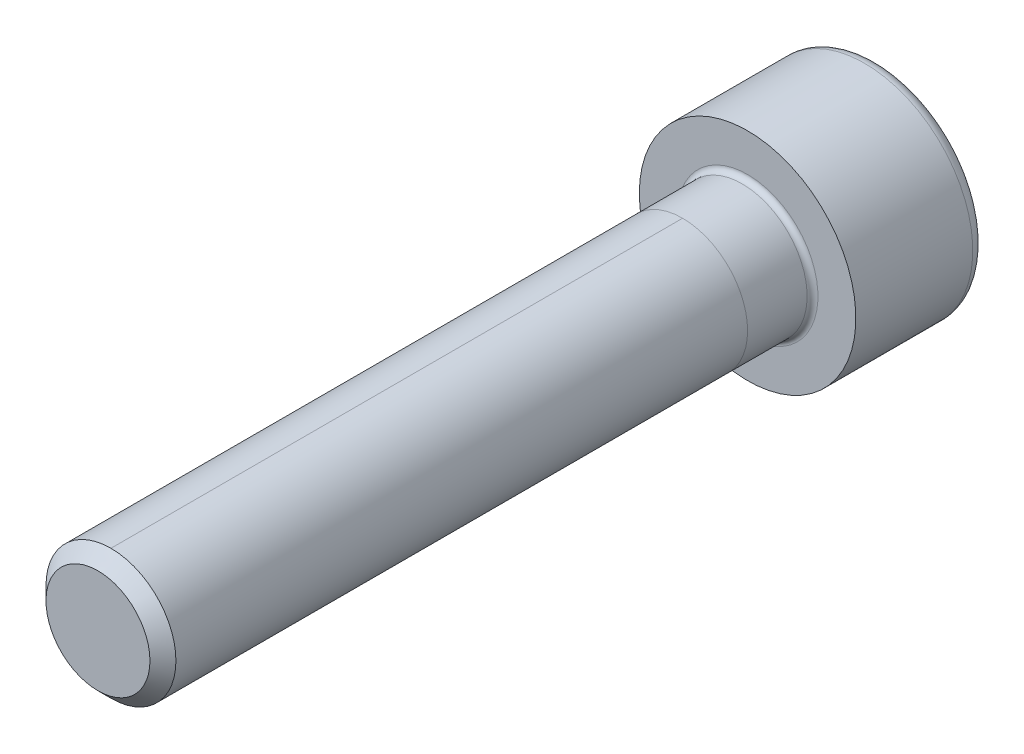
ISO-10303-21;
HEADER;
FILE_DESCRIPTION(('STEP AP214'),'2;1');
FILE_NAME('part.step','',(''),(''),'','','');
FILE_SCHEMA(('AUTOMOTIVE_DESIGN { 1 0 10303 214 1 1 1 1 }'));
ENDSEC;
DATA;
#1=APPLICATION_CONTEXT('core data for automotive mechanical design processes');
#2=APPLICATION_PROTOCOL_DEFINITION('international standard','automotive_design',2000,#1);
#3=PRODUCT_CONTEXT('',#1,'mechanical');
#4=PRODUCT('Part','Part','',(#3));
#5=PRODUCT_RELATED_PRODUCT_CATEGORY('part','',(#4));
#6=PRODUCT_DEFINITION_FORMATION('','',#4);
#7=PRODUCT_DEFINITION_CONTEXT('part definition',#1,'design');
#8=PRODUCT_DEFINITION('design','',#6,#7);
#9=PRODUCT_DEFINITION_SHAPE('','',#8);
#10=(LENGTH_UNIT() NAMED_UNIT(*) SI_UNIT(.MILLI.,.METRE.));
#11=(NAMED_UNIT(*) PLANE_ANGLE_UNIT() SI_UNIT($,.RADIAN.));
#12=(NAMED_UNIT(*) SI_UNIT($,.STERADIAN.) SOLID_ANGLE_UNIT());
#13=UNCERTAINTY_MEASURE_WITH_UNIT(LENGTH_MEASURE(1.E-05),#10,'distance_accuracy_value','');
#14=(GEOMETRIC_REPRESENTATION_CONTEXT(3) GLOBAL_UNCERTAINTY_ASSIGNED_CONTEXT((#13)) GLOBAL_UNIT_ASSIGNED_CONTEXT((#10,
#11,#12)) REPRESENTATION_CONTEXT('',''));
#15=CARTESIAN_POINT('',(0.,0.,0.));
#16=DIRECTION('',(0.,0.,1.));
#17=DIRECTION('',(1.,0.,0.));
#18=AXIS2_PLACEMENT_3D('',#15,#16,#17);
#19=CARTESIAN_POINT('',(0.,0.,30.));
#20=DIRECTION('',(0.,0.,-1.));
#21=DIRECTION('',(-1.,0.,0.));
#22=AXIS2_PLACEMENT_3D('',#19,#20,#21);
#23=CYLINDRICAL_SURFACE('',#22,3.);
#24=DIRECTION('',(0.,0.,-1.));
#25=VECTOR('',#24,1.);
#26=CARTESIAN_POINT('',(0.,3.,30.));
#27=LINE('',#26,#25);
#28=CARTESIAN_POINT('',(0.,3.,29.4));
#29=VERTEX_POINT('',#28);
#30=CARTESIAN_POINT('',(0.,3.,3.));
#31=VERTEX_POINT('',#30);
#32=EDGE_CURVE('E58',#29,#31,#27,.T.);
#33=ORIENTED_EDGE('',*,*,#32,.F.);
#34=CARTESIAN_POINT('',(0.,0.,29.4));
#35=DIRECTION('',(0.,0.,1.));
#36=DIRECTION('',(1.,0.,0.));
#37=AXIS2_PLACEMENT_3D('',#34,#35,#36);
#38=CIRCLE('',#37,3.);
#39=CARTESIAN_POINT('',(0.,-3.,29.4));
#40=VERTEX_POINT('',#39);
#41=EDGE_CURVE('E192',#29,#40,#38,.F.);
#42=ORIENTED_EDGE('',*,*,#41,.T.);
#43=DIRECTION('',(0.,0.,-1.));
#44=VECTOR('',#43,1.);
#45=CARTESIAN_POINT('',(0.,-3.,30.));
#46=LINE('',#45,#44);
#47=CARTESIAN_POINT('',(0.,-3.,3.));
#48=VERTEX_POINT('',#47);
#49=EDGE_CURVE('E195',#40,#48,#46,.T.);
#50=ORIENTED_EDGE('',*,*,#49,.T.);
#51=CARTESIAN_POINT('',(0.,0.,3.));
#52=DIRECTION('',(0.,0.,1.));
#53=DIRECTION('',(0.,-1.,0.));
#54=AXIS2_PLACEMENT_3D('',#51,#52,#53);
#55=CIRCLE('',#54,3.);
#56=EDGE_CURVE('E64',#48,#31,#55,.T.);
#57=ORIENTED_EDGE('',*,*,#56,.T.);
#58=EDGE_LOOP('',(#33,#42,#50,#57));
#59=FACE_BOUND('',#58,.T.);
#60=ADVANCED_FACE('F43',(#59),#23,.T.);
#61=CARTESIAN_POINT('',(0.,0.,0.25));
#62=DIRECTION('',(0.,0.,-1.));
#63=DIRECTION('',(-1.,0.,0.));
#64=AXIS2_PLACEMENT_3D('',#61,#62,#63);
#65=CIRCLE('',#64,3.);
#66=CARTESIAN_POINT('',(-3.,0.,0.25));
#67=VERTEX_POINT('',#66);
#68=EDGE_CURVE('E12',#67,#67,#65,.F.);
#69=ORIENTED_EDGE('',*,*,#68,.T.);
#70=EDGE_LOOP('',(#69));
#71=FACE_BOUND('',#70,.T.);
#72=ORIENTED_EDGE('',*,*,#56,.F.);
#73=EDGE_CURVE('E217',#31,#48,#55,.T.);
#74=ORIENTED_EDGE('',*,*,#73,.F.);
#75=EDGE_LOOP('',(#72,#74));
#76=FACE_BOUND('',#75,.T.);
#77=ADVANCED_FACE('F235',(#71,#76),#23,.T.);
#78=EDGE_CURVE('E193',#40,#29,#38,.F.);
#79=ORIENTED_EDGE('',*,*,#78,.T.);
#80=ORIENTED_EDGE('',*,*,#32,.T.);
#81=ORIENTED_EDGE('',*,*,#73,.T.);
#82=ORIENTED_EDGE('',*,*,#49,.F.);
#83=EDGE_LOOP('',(#79,#80,#81,#82));
#84=FACE_BOUND('',#83,.T.);
#85=ADVANCED_FACE('F238',(#84),#23,.T.);
#86=CARTESIAN_POINT('',(0.,0.,30.));
#87=DIRECTION('',(0.,0.,1.));
#88=DIRECTION('',(1.,0.,0.));
#89=AXIS2_PLACEMENT_3D('',#86,#87,#88);
#90=PLANE('',#89);
#91=CARTESIAN_POINT('',(0.,0.,30.));
#92=DIRECTION('',(0.,0.,1.));
#93=DIRECTION('',(1.,0.,0.));
#94=AXIS2_PLACEMENT_3D('',#91,#92,#93);
#95=CIRCLE('',#94,2.4);
#96=CARTESIAN_POINT('',(2.4,0.,30.));
#97=VERTEX_POINT('',#96);
#98=EDGE_CURVE('E189',#97,#97,#95,.T.);
#99=ORIENTED_EDGE('',*,*,#98,.T.);
#100=EDGE_LOOP('',(#99));
#101=FACE_BOUND('',#100,.T.);
#102=ADVANCED_FACE('F246',(#101),#90,.T.);
#103=CARTESIAN_POINT('',(0.,0.,0.));
#104=DIRECTION('',(0.,0.,-1.));
#105=DIRECTION('',(-1.,0.,0.));
#106=AXIS2_PLACEMENT_3D('',#103,#104,#105);
#107=PLANE('',#106);
#108=CARTESIAN_POINT('',(0.,0.,0.));
#109=DIRECTION('',(0.,0.,-1.));
#110=DIRECTION('',(-1.,0.,0.));
#111=AXIS2_PLACEMENT_3D('',#108,#109,#110);
#112=CIRCLE('',#111,3.25);
#113=CARTESIAN_POINT('',(-3.25,0.,0.));
#114=VERTEX_POINT('',#113);
#115=EDGE_CURVE('E51',#114,#114,#112,.T.);
#116=ORIENTED_EDGE('',*,*,#115,.T.);
#117=EDGE_LOOP('',(#116));
#118=FACE_BOUND('',#117,.T.);
#119=CARTESIAN_POINT('',(0.,0.,0.));
#120=DIRECTION('',(0.,0.,-1.));
#121=DIRECTION('',(-1.,0.,0.));
#122=AXIS2_PLACEMENT_3D('',#119,#120,#121);
#123=CIRCLE('',#122,5.);
#124=CARTESIAN_POINT('',(-5.,0.,0.));
#125=VERTEX_POINT('',#124);
#126=EDGE_CURVE('E179',#125,#125,#123,.T.);
#127=ORIENTED_EDGE('',*,*,#126,.F.);
#128=EDGE_LOOP('',(#127));
#129=FACE_BOUND('',#128,.T.);
#130=ADVANCED_FACE('F224',(#118,#129),#107,.F.);
#131=CARTESIAN_POINT('',(0.,0.,-6.));
#132=DIRECTION('',(0.,0.,1.));
#133=DIRECTION('',(1.,0.,0.));
#134=AXIS2_PLACEMENT_3D('',#131,#132,#133);
#135=CYLINDRICAL_SURFACE('',#134,5.);
#136=CARTESIAN_POINT('',(0.,0.,-5.4));
#137=DIRECTION('',(0.,0.,-1.));
#138=DIRECTION('',(-1.,0.,0.));
#139=AXIS2_PLACEMENT_3D('',#136,#137,#138);
#140=CIRCLE('',#139,5.);
#141=CARTESIAN_POINT('',(-5.,0.,-5.4));
#142=VERTEX_POINT('',#141);
#143=EDGE_CURVE('E186',#142,#142,#140,.F.);
#144=ORIENTED_EDGE('',*,*,#143,.T.);
#145=EDGE_LOOP('',(#144));
#146=FACE_BOUND('',#145,.T.);
#147=ORIENTED_EDGE('',*,*,#126,.T.);
#148=EDGE_LOOP('',(#147));
#149=FACE_BOUND('',#148,.T.);
#150=ADVANCED_FACE('F282',(#146,#149),#135,.T.);
#151=CARTESIAN_POINT('',(0.,0.,-6.));
#152=DIRECTION('',(0.,0.,-1.));
#153=DIRECTION('',(-1.,0.,0.));
#154=AXIS2_PLACEMENT_3D('',#151,#152,#153);
#155=PLANE('',#154);
#156=DIRECTION('',(0.5,-0.866025403784439,0.));
#157=VECTOR('',#156,1.);
#158=CARTESIAN_POINT('',(1.44337567297406,2.5,-6.));
#159=LINE('',#158,#157);
#160=CARTESIAN_POINT('',(1.44337567297406,2.5,-6.));
#161=VERTEX_POINT('',#160);
#162=CARTESIAN_POINT('',(2.88675134594813,0.,-6.));
#163=VERTEX_POINT('',#162);
#164=EDGE_CURVE('E122',#161,#163,#159,.T.);
#165=ORIENTED_EDGE('',*,*,#164,.F.);
#166=DIRECTION('',(1.,0.,0.));
#167=VECTOR('',#166,1.);
#168=CARTESIAN_POINT('',(-1.44337567297406,2.5,-6.));
#169=LINE('',#168,#167);
#170=CARTESIAN_POINT('',(-1.44337567297406,2.5,-6.));
#171=VERTEX_POINT('',#170);
#172=EDGE_CURVE('E176',#171,#161,#169,.T.);
#173=ORIENTED_EDGE('',*,*,#172,.F.);
#174=DIRECTION('',(0.5,0.866025403784439,0.));
#175=VECTOR('',#174,1.);
#176=CARTESIAN_POINT('',(-2.88675134594813,0.,-6.));
#177=LINE('',#176,#175);
#178=CARTESIAN_POINT('',(-2.88675134594813,0.,-6.));
#179=VERTEX_POINT('',#178);
#180=EDGE_CURVE('E173',#179,#171,#177,.T.);
#181=ORIENTED_EDGE('',*,*,#180,.F.);
#182=DIRECTION('',(-0.5,0.866025403784439,0.));
#183=VECTOR('',#182,1.);
#184=CARTESIAN_POINT('',(-1.44337567297407,-2.5,-6.));
#185=LINE('',#184,#183);
#186=CARTESIAN_POINT('',(-1.44337567297407,-2.5,-6.));
#187=VERTEX_POINT('',#186);
#188=EDGE_CURVE('E170',#187,#179,#185,.T.);
#189=ORIENTED_EDGE('',*,*,#188,.F.);
#190=DIRECTION('',(-1.,0.,0.));
#191=VECTOR('',#190,1.);
#192=CARTESIAN_POINT('',(1.44337567297406,-2.5,-6.));
#193=LINE('',#192,#191);
#194=CARTESIAN_POINT('',(1.44337567297406,-2.5,-6.));
#195=VERTEX_POINT('',#194);
#196=EDGE_CURVE('E167',#195,#187,#193,.T.);
#197=ORIENTED_EDGE('',*,*,#196,.F.);
#198=DIRECTION('',(-0.5,-0.866025403784439,0.));
#199=VECTOR('',#198,1.);
#200=CARTESIAN_POINT('',(2.88675134594813,0.,-6.));
#201=LINE('',#200,#199);
#202=EDGE_CURVE('E164',#163,#195,#201,.T.);
#203=ORIENTED_EDGE('',*,*,#202,.F.);
#204=EDGE_LOOP('',(#165,#173,#181,#189,#197,#203));
#205=FACE_BOUND('',#204,.T.);
#206=CARTESIAN_POINT('',(0.,0.,-6.));
#207=DIRECTION('',(0.,0.,-1.));
#208=DIRECTION('',(-1.,0.,0.));
#209=AXIS2_PLACEMENT_3D('',#206,#207,#208);
#210=CIRCLE('',#209,4.4);
#211=CARTESIAN_POINT('',(-4.4,0.,-6.));
#212=VERTEX_POINT('',#211);
#213=EDGE_CURVE('E182',#212,#212,#210,.T.);
#214=ORIENTED_EDGE('',*,*,#213,.T.);
#215=EDGE_LOOP('',(#214));
#216=FACE_BOUND('',#215,.T.);
#217=ADVANCED_FACE('F277',(#205,#216),#155,.T.);
#218=CARTESIAN_POINT('',(0.,0.,-5.4));
#219=DIRECTION('',(0.,0.,-1.));
#220=DIRECTION('',(-1.,0.,0.));
#221=AXIS2_PLACEMENT_3D('',#218,#219,#220);
#222=TOROIDAL_SURFACE('',#221,4.4,0.6);
#223=ORIENTED_EDGE('',*,*,#143,.F.);
#224=EDGE_LOOP('',(#223));
#225=FACE_BOUND('',#224,.T.);
#226=ORIENTED_EDGE('',*,*,#213,.F.);
#227=EDGE_LOOP('',(#226));
#228=FACE_BOUND('',#227,.T.);
#229=ADVANCED_FACE('F268',(#225,#228),#222,.T.);
#230=CARTESIAN_POINT('',(0.,0.,30.));
#231=DIRECTION('',(0.,0.,-1.));
#232=DIRECTION('',(-1.,0.,0.));
#233=AXIS2_PLACEMENT_3D('',#230,#231,#232);
#234=CONICAL_SURFACE('',#233,2.4,0.785398163397444);
#235=ORIENTED_EDGE('',*,*,#78,.F.);
#236=ORIENTED_EDGE('',*,*,#41,.F.);
#237=EDGE_LOOP('',(#235,#236));
#238=FACE_BOUND('',#237,.T.);
#239=ORIENTED_EDGE('',*,*,#98,.F.);
#240=EDGE_LOOP('',(#239));
#241=FACE_BOUND('',#240,.T.);
#242=ADVANCED_FACE('F255',(#238,#241),#234,.T.);
#243=CARTESIAN_POINT('',(1.44337567297406,2.5,-3.77777777777778));
#244=DIRECTION('',(0.866025403784439,0.5,0.));
#245=DIRECTION('',(-0.5,0.866025403784439,0.));
#246=AXIS2_PLACEMENT_3D('',#243,#244,#245);
#247=PLANE('',#246);
#248=ORIENTED_EDGE('',*,*,#164,.T.);
#249=DIRECTION('',(0.,0.,-1.));
#250=VECTOR('',#249,1.);
#251=CARTESIAN_POINT('',(2.88675134594813,0.,-3.77777777777778));
#252=LINE('',#251,#250);
#253=CARTESIAN_POINT('',(2.88675134594813,0.,-3.77777777777778));
#254=VERTEX_POINT('',#253);
#255=EDGE_CURVE('E200',#254,#163,#252,.T.);
#256=ORIENTED_EDGE('',*,*,#255,.F.);
#257=DIRECTION('',(-0.5,0.866025403784439,0.));
#258=VECTOR('',#257,1.);
#259=CARTESIAN_POINT('',(2.88675134594813,0.,-3.77777777777778));
#260=LINE('',#259,#258);
#261=CARTESIAN_POINT('',(1.44337567297406,2.5,-3.77777777777778));
#262=VERTEX_POINT('',#261);
#263=EDGE_CURVE('E117',#262,#254,#260,.F.);
#264=ORIENTED_EDGE('',*,*,#263,.F.);
#265=DIRECTION('',(0.,0.,-1.));
#266=VECTOR('',#265,1.);
#267=CARTESIAN_POINT('',(1.44337567297406,2.5,-3.77777777777778));
#268=LINE('',#267,#266);
#269=EDGE_CURVE('E183',#262,#161,#268,.T.);
#270=ORIENTED_EDGE('',*,*,#269,.T.);
#271=EDGE_LOOP('',(#248,#256,#264,#270));
#272=FACE_BOUND('',#271,.T.);
#273=ADVANCED_FACE('F267',(#272),#247,.F.);
#274=CARTESIAN_POINT('',(-1.44337567297406,2.5,-3.77777777777778));
#275=DIRECTION('',(0.,1.,0.));
#276=DIRECTION('',(0.,0.,1.));
#277=AXIS2_PLACEMENT_3D('',#274,#275,#276);
#278=PLANE('',#277);
#279=ORIENTED_EDGE('',*,*,#172,.T.);
#280=ORIENTED_EDGE('',*,*,#269,.F.);
#281=DIRECTION('',(1.,0.,0.));
#282=VECTOR('',#281,1.);
#283=CARTESIAN_POINT('',(0.,2.5,-3.77777777777778));
#284=LINE('',#283,#282);
#285=CARTESIAN_POINT('',(-1.44337567297406,2.5,-3.77777777777778));
#286=VERTEX_POINT('',#285);
#287=EDGE_CURVE('E131',#286,#262,#284,.T.);
#288=ORIENTED_EDGE('',*,*,#287,.F.);
#289=DIRECTION('',(0.,0.,-1.));
#290=VECTOR('',#289,1.);
#291=CARTESIAN_POINT('',(-1.44337567297406,2.5,-3.77777777777778));
#292=LINE('',#291,#290);
#293=EDGE_CURVE('E196',#286,#171,#292,.T.);
#294=ORIENTED_EDGE('',*,*,#293,.T.);
#295=EDGE_LOOP('',(#279,#280,#288,#294));
#296=FACE_BOUND('',#295,.T.);
#297=ADVANCED_FACE('F274',(#296),#278,.F.);
#298=CARTESIAN_POINT('',(-2.88675134594813,0.,-3.77777777777778));
#299=DIRECTION('',(-0.866025403784439,0.5,0.));
#300=DIRECTION('',(-0.5,-0.866025403784439,0.));
#301=AXIS2_PLACEMENT_3D('',#298,#299,#300);
#302=PLANE('',#301);
#303=ORIENTED_EDGE('',*,*,#180,.T.);
#304=ORIENTED_EDGE('',*,*,#293,.F.);
#305=DIRECTION('',(-0.5,-0.866025403784439,0.));
#306=VECTOR('',#305,1.);
#307=CARTESIAN_POINT('',(-1.44337567297406,2.5,-3.77777777777778));
#308=LINE('',#307,#306);
#309=CARTESIAN_POINT('',(-2.88675134594813,0.,-3.77777777777778));
#310=VERTEX_POINT('',#309);
#311=EDGE_CURVE('E139',#310,#286,#308,.F.);
#312=ORIENTED_EDGE('',*,*,#311,.F.);
#313=DIRECTION('',(0.,0.,-1.));
#314=VECTOR('',#313,1.);
#315=CARTESIAN_POINT('',(-2.88675134594813,0.,-3.77777777777778));
#316=LINE('',#315,#314);
#317=EDGE_CURVE('E198',#310,#179,#316,.T.);
#318=ORIENTED_EDGE('',*,*,#317,.T.);
#319=EDGE_LOOP('',(#303,#304,#312,#318));
#320=FACE_BOUND('',#319,.T.);
#321=ADVANCED_FACE('F310',(#320),#302,.F.);
#322=CARTESIAN_POINT('',(-1.44337567297407,-2.5,-3.77777777777778));
#323=DIRECTION('',(-0.866025403784439,-0.5,0.));
#324=DIRECTION('',(0.5,-0.866025403784439,0.));
#325=AXIS2_PLACEMENT_3D('',#322,#323,#324);
#326=PLANE('',#325);
#327=ORIENTED_EDGE('',*,*,#188,.T.);
#328=ORIENTED_EDGE('',*,*,#317,.F.);
#329=DIRECTION('',(0.5,-0.866025403784439,0.));
#330=VECTOR('',#329,1.);
#331=CARTESIAN_POINT('',(-2.88675134594813,0.,-3.77777777777778));
#332=LINE('',#331,#330);
#333=CARTESIAN_POINT('',(-1.44337567297407,-2.5,-3.77777777777778));
#334=VERTEX_POINT('',#333);
#335=EDGE_CURVE('E147',#334,#310,#332,.F.);
#336=ORIENTED_EDGE('',*,*,#335,.F.);
#337=DIRECTION('',(0.,0.,-1.));
#338=VECTOR('',#337,1.);
#339=CARTESIAN_POINT('',(-1.44337567297407,-2.5,-3.77777777777778));
#340=LINE('',#339,#338);
#341=EDGE_CURVE('E205',#334,#187,#340,.T.);
#342=ORIENTED_EDGE('',*,*,#341,.T.);
#343=EDGE_LOOP('',(#327,#328,#336,#342));
#344=FACE_BOUND('',#343,.T.);
#345=ADVANCED_FACE('F306',(#344),#326,.F.);
#346=CARTESIAN_POINT('',(1.44337567297406,-2.5,-3.77777777777778));
#347=DIRECTION('',(0.,-1.,0.));
#348=DIRECTION('',(1.,0.,0.));
#349=AXIS2_PLACEMENT_3D('',#346,#347,#348);
#350=PLANE('',#349);
#351=ORIENTED_EDGE('',*,*,#196,.T.);
#352=ORIENTED_EDGE('',*,*,#341,.F.);
#353=DIRECTION('',(1.,0.,0.));
#354=VECTOR('',#353,1.);
#355=CARTESIAN_POINT('',(0.,-2.5,-3.77777777777778));
#356=LINE('',#355,#354);
#357=CARTESIAN_POINT('',(1.44337567297407,-2.5,-3.77777777777778));
#358=VERTEX_POINT('',#357);
#359=EDGE_CURVE('E154',#358,#334,#356,.F.);
#360=ORIENTED_EDGE('',*,*,#359,.F.);
#361=DIRECTION('',(0.,0.,-1.));
#362=VECTOR('',#361,1.);
#363=CARTESIAN_POINT('',(1.44337567297406,-2.5,-3.77777777777778));
#364=LINE('',#363,#362);
#365=EDGE_CURVE('E203',#358,#195,#364,.T.);
#366=ORIENTED_EDGE('',*,*,#365,.T.);
#367=EDGE_LOOP('',(#351,#352,#360,#366));
#368=FACE_BOUND('',#367,.T.);
#369=ADVANCED_FACE('F302',(#368),#350,.F.);
#370=CARTESIAN_POINT('',(2.88675134594813,0.,-3.77777777777778));
#371=DIRECTION('',(0.866025403784439,-0.5,0.));
#372=DIRECTION('',(0.5,0.866025403784439,0.));
#373=AXIS2_PLACEMENT_3D('',#370,#371,#372);
#374=PLANE('',#373);
#375=ORIENTED_EDGE('',*,*,#202,.T.);
#376=ORIENTED_EDGE('',*,*,#365,.F.);
#377=DIRECTION('',(0.5,0.866025403784439,0.));
#378=VECTOR('',#377,1.);
#379=CARTESIAN_POINT('',(1.44337567297406,-2.5,-3.77777777777778));
#380=LINE('',#379,#378);
#381=EDGE_CURVE('E159',#254,#358,#380,.F.);
#382=ORIENTED_EDGE('',*,*,#381,.F.);
#383=ORIENTED_EDGE('',*,*,#255,.T.);
#384=EDGE_LOOP('',(#375,#376,#382,#383));
#385=FACE_BOUND('',#384,.T.);
#386=ADVANCED_FACE('F299',(#385),#374,.F.);
#387=CARTESIAN_POINT('',(-0.789711898233946,-0.455940377027619,-2.56466462078036));
#388=DIRECTION('',(0.290126882702443,0.167504833827403,0.942214690279141));
#389=DIRECTION('',(0.955717783517745,0.,-0.294284757111084));
#390=AXIS2_PLACEMENT_3D('',#387,#388,#389);
#391=PLANE('',#390);
#392=DIRECTION('',(-0.477858891758872,-0.827675879374923,0.294284757111084));
#393=VECTOR('',#392,1.);
#394=CARTESIAN_POINT('',(1.44337567297406,2.5,-3.77777777777778));
#395=LINE('',#394,#393);
#396=CARTESIAN_POINT('',(0.,0.,-2.88888888888889));
#397=VERTEX_POINT('',#396);
#398=EDGE_CURVE('E114',#262,#397,#395,.T.);
#399=ORIENTED_EDGE('',*,*,#398,.F.);
#400=ORIENTED_EDGE('',*,*,#263,.T.);
#401=DIRECTION('',(-0.955717783517745,0.,0.294284757111084));
#402=VECTOR('',#401,1.);
#403=CARTESIAN_POINT('',(2.88675134594813,0.,-3.77777777777778));
#404=LINE('',#403,#402);
#405=EDGE_CURVE('E111',#254,#397,#404,.T.);
#406=ORIENTED_EDGE('',*,*,#405,.T.);
#407=EDGE_LOOP('',(#399,#400,#406));
#408=FACE_BOUND('',#407,.T.);
#409=ADVANCED_FACE('F113',(#408),#391,.F.);
#410=CARTESIAN_POINT('',(-0.789711898233947,0.455940377027619,-2.56466462078036));
#411=DIRECTION('',(0.290126882702444,-0.167504833827403,0.942214690279141));
#412=DIRECTION('',(0.955717783517745,0.,-0.294284757111084));
#413=AXIS2_PLACEMENT_3D('',#410,#411,#412);
#414=PLANE('',#413);
#415=ORIENTED_EDGE('',*,*,#405,.F.);
#416=ORIENTED_EDGE('',*,*,#381,.T.);
#417=DIRECTION('',(-0.477858891758872,0.827675879374923,0.294284757111084));
#418=VECTOR('',#417,1.);
#419=CARTESIAN_POINT('',(1.44337567297406,-2.5,-3.77777777777778));
#420=LINE('',#419,#418);
#421=EDGE_CURVE('E152',#358,#397,#420,.T.);
#422=ORIENTED_EDGE('',*,*,#421,.T.);
#423=EDGE_LOOP('',(#415,#416,#422));
#424=FACE_BOUND('',#423,.T.);
#425=ADVANCED_FACE('F157',(#424),#414,.F.);
#426=CARTESIAN_POINT('',(0.,-0.911880754055239,-2.56466462078036));
#427=DIRECTION('',(0.,0.335009667654805,0.942214690279141));
#428=DIRECTION('',(0.,-0.942214690279141,0.335009667654805));
#429=AXIS2_PLACEMENT_3D('',#426,#427,#428);
#430=PLANE('',#429);
#431=DIRECTION('',(0.477858891758872,-0.827675879374923,0.294284757111084));
#432=VECTOR('',#431,1.);
#433=CARTESIAN_POINT('',(-1.44337567297406,2.5,-3.77777777777778));
#434=LINE('',#433,#432);
#435=EDGE_CURVE('E128',#286,#397,#434,.T.);
#436=ORIENTED_EDGE('',*,*,#435,.F.);
#437=ORIENTED_EDGE('',*,*,#287,.T.);
#438=ORIENTED_EDGE('',*,*,#398,.T.);
#439=EDGE_LOOP('',(#436,#437,#438));
#440=FACE_BOUND('',#439,.T.);
#441=ADVANCED_FACE('F127',(#440),#430,.F.);
#442=CARTESIAN_POINT('',(0.789711898233947,-0.45594037702762,-2.56466462078036));
#443=DIRECTION('',(-0.290126882702443,0.167504833827403,0.942214690279141));
#444=DIRECTION('',(0.955717783517745,0.,0.294284757111084));
#445=AXIS2_PLACEMENT_3D('',#442,#443,#444);
#446=PLANE('',#445);
#447=DIRECTION('',(0.955717783517745,0.,0.294284757111084));
#448=VECTOR('',#447,1.);
#449=CARTESIAN_POINT('',(-2.88675134594813,0.,-3.77777777777778));
#450=LINE('',#449,#448);
#451=EDGE_CURVE('E136',#310,#397,#450,.T.);
#452=ORIENTED_EDGE('',*,*,#451,.F.);
#453=ORIENTED_EDGE('',*,*,#311,.T.);
#454=ORIENTED_EDGE('',*,*,#435,.T.);
#455=EDGE_LOOP('',(#452,#453,#454));
#456=FACE_BOUND('',#455,.T.);
#457=ADVANCED_FACE('F135',(#456),#446,.F.);
#458=CARTESIAN_POINT('',(0.789711898233947,0.455940377027619,-2.56466462078036));
#459=DIRECTION('',(-0.290126882702444,-0.167504833827403,0.942214690279141));
#460=DIRECTION('',(0.955717783517745,0.,0.294284757111084));
#461=AXIS2_PLACEMENT_3D('',#458,#459,#460);
#462=PLANE('',#461);
#463=DIRECTION('',(0.477858891758872,0.827675879374923,0.294284757111084));
#464=VECTOR('',#463,1.);
#465=CARTESIAN_POINT('',(-1.44337567297407,-2.5,-3.77777777777778));
#466=LINE('',#465,#464);
#467=EDGE_CURVE('E144',#334,#397,#466,.T.);
#468=ORIENTED_EDGE('',*,*,#467,.F.);
#469=ORIENTED_EDGE('',*,*,#335,.T.);
#470=ORIENTED_EDGE('',*,*,#451,.T.);
#471=EDGE_LOOP('',(#468,#469,#470));
#472=FACE_BOUND('',#471,.T.);
#473=ADVANCED_FACE('F143',(#472),#462,.F.);
#474=CARTESIAN_POINT('',(0.,0.911880754055239,-2.56466462078036));
#475=DIRECTION('',(0.,-0.335009667654805,0.942214690279141));
#476=DIRECTION('',(0.,-0.942214690279141,-0.335009667654805));
#477=AXIS2_PLACEMENT_3D('',#474,#475,#476);
#478=PLANE('',#477);
#479=ORIENTED_EDGE('',*,*,#421,.F.);
#480=ORIENTED_EDGE('',*,*,#359,.T.);
#481=ORIENTED_EDGE('',*,*,#467,.T.);
#482=EDGE_LOOP('',(#479,#480,#481));
#483=FACE_BOUND('',#482,.T.);
#484=ADVANCED_FACE('F151',(#483),#478,.F.);
#485=CARTESIAN_POINT('',(0.,0.,0.25));
#486=DIRECTION('',(0.,0.,-1.));
#487=DIRECTION('',(-1.,0.,0.));
#488=AXIS2_PLACEMENT_3D('',#485,#486,#487);
#489=TOROIDAL_SURFACE('',#488,3.25,0.25);
#490=ORIENTED_EDGE('',*,*,#68,.F.);
#491=EDGE_LOOP('',(#490));
#492=FACE_BOUND('',#491,.T.);
#493=ORIENTED_EDGE('',*,*,#115,.F.);
#494=EDGE_LOOP('',(#493));
#495=FACE_BOUND('',#494,.T.);
#496=ADVANCED_FACE('F45',(#492,#495),#489,.F.);
#497=CLOSED_SHELL('',(#60,#77,#85,#102,#130,#150,#217,#229,#242,#273,#297,#321,#345,#369,#386,
#409,#425,#441,#457,#473,#484,#496));
#498=MANIFOLD_SOLID_BREP('B2',#497);
#499=ADVANCED_BREP_SHAPE_REPRESENTATION('',(#18,#498),#14);
#500=SHAPE_DEFINITION_REPRESENTATION(#9,#499);
ENDSEC;
END-ISO-10303-21;
